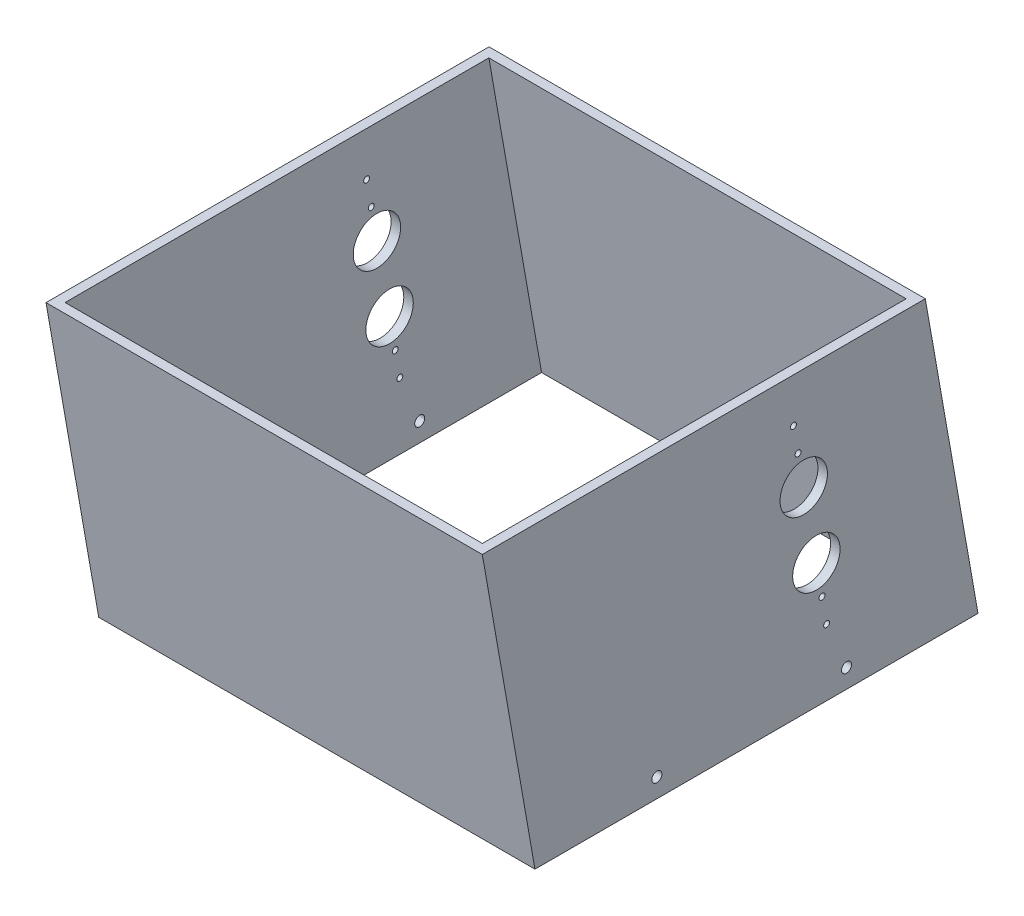
ISO-10303-21;
HEADER;
FILE_DESCRIPTION(('STEP AP214'),'2;1');
FILE_NAME('part.step','',(''),(''),'','','');
FILE_SCHEMA(('AUTOMOTIVE_DESIGN { 1 0 10303 214 1 1 1 1 }'));
ENDSEC;
DATA;
#1=APPLICATION_CONTEXT('core data for automotive mechanical design processes');
#2=APPLICATION_PROTOCOL_DEFINITION('international standard','automotive_design',2000,#1);
#3=PRODUCT_CONTEXT('',#1,'mechanical');
#4=PRODUCT('Part','Part','',(#3));
#5=PRODUCT_RELATED_PRODUCT_CATEGORY('part','',(#4));
#6=PRODUCT_DEFINITION_FORMATION('','',#4);
#7=PRODUCT_DEFINITION_CONTEXT('part definition',#1,'design');
#8=PRODUCT_DEFINITION('design','',#6,#7);
#9=PRODUCT_DEFINITION_SHAPE('','',#8);
#10=(LENGTH_UNIT() NAMED_UNIT(*) SI_UNIT(.MILLI.,.METRE.));
#11=(NAMED_UNIT(*) PLANE_ANGLE_UNIT() SI_UNIT($,.RADIAN.));
#12=(NAMED_UNIT(*) SI_UNIT($,.STERADIAN.) SOLID_ANGLE_UNIT());
#13=UNCERTAINTY_MEASURE_WITH_UNIT(LENGTH_MEASURE(1.E-05),#10,'distance_accuracy_value','');
#14=(GEOMETRIC_REPRESENTATION_CONTEXT(3) GLOBAL_UNCERTAINTY_ASSIGNED_CONTEXT((#13)) GLOBAL_UNIT_ASSIGNED_CONTEXT((#10,
#11,#12)) REPRESENTATION_CONTEXT('',''));
#15=CARTESIAN_POINT('',(0.,0.,0.));
#16=DIRECTION('',(0.,0.,1.));
#17=DIRECTION('',(1.,0.,0.));
#18=AXIS2_PLACEMENT_3D('',#15,#16,#17);
#19=CARTESIAN_POINT('',(-146.05,-68.6111825086534,-215.208710697034));
#20=DIRECTION('',(1.,0.,0.));
#21=DIRECTION('',(0.,0.,-1.));
#22=AXIS2_PLACEMENT_3D('',#19,#20,#21);
#23=CYLINDRICAL_SURFACE('',#22,15.875);
#24=CARTESIAN_POINT('',(139.7,-68.6111825086534,-215.208710697034));
#25=DIRECTION('',(1.,0.,0.));
#26=DIRECTION('',(0.,0.,-1.));
#27=AXIS2_PLACEMENT_3D('',#24,#25,#26);
#28=CIRCLE('',#27,15.875);
#29=CARTESIAN_POINT('',(139.7,-68.6111825086534,-231.083710697034));
#30=VERTEX_POINT('',#29);
#31=EDGE_CURVE('E20',#30,#30,#28,.F.);
#32=ORIENTED_EDGE('',*,*,#31,.T.);
#33=EDGE_LOOP('',(#32));
#34=FACE_BOUND('',#33,.T.);
#35=CARTESIAN_POINT('',(146.05,-68.6111825086534,-215.208710697034));
#36=DIRECTION('',(1.,0.,0.));
#37=DIRECTION('',(0.,0.,-1.));
#38=AXIS2_PLACEMENT_3D('',#35,#36,#37);
#39=CIRCLE('',#38,15.875);
#40=CARTESIAN_POINT('',(146.05,-68.6111825086534,-231.083710697034));
#41=VERTEX_POINT('',#40);
#42=EDGE_CURVE('E167',#41,#41,#39,.F.);
#43=ORIENTED_EDGE('',*,*,#42,.F.);
#44=EDGE_LOOP('',(#43));
#45=FACE_BOUND('',#44,.T.);
#46=ADVANCED_FACE('F17',(#34,#45),#23,.F.);
#47=CARTESIAN_POINT('',(-146.05,-116.638287007542,-223.677185025482));
#48=DIRECTION('',(1.,0.,0.));
#49=DIRECTION('',(0.,0.,-1.));
#50=AXIS2_PLACEMENT_3D('',#47,#48,#49);
#51=CYLINDRICAL_SURFACE('',#50,15.875);
#52=CARTESIAN_POINT('',(139.7,-116.638287007542,-223.677185025482));
#53=DIRECTION('',(1.,0.,0.));
#54=DIRECTION('',(0.,0.,-1.));
#55=AXIS2_PLACEMENT_3D('',#52,#53,#54);
#56=CIRCLE('',#55,15.875);
#57=CARTESIAN_POINT('',(139.7,-116.638287007542,-239.552185025482));
#58=VERTEX_POINT('',#57);
#59=EDGE_CURVE('E209',#58,#58,#56,.F.);
#60=ORIENTED_EDGE('',*,*,#59,.T.);
#61=EDGE_LOOP('',(#60));
#62=FACE_BOUND('',#61,.T.);
#63=CARTESIAN_POINT('',(146.05,-116.638287007542,-223.677185025482));
#64=DIRECTION('',(1.,0.,0.));
#65=DIRECTION('',(0.,0.,-1.));
#66=AXIS2_PLACEMENT_3D('',#63,#64,#65);
#67=CIRCLE('',#66,15.875);
#68=CARTESIAN_POINT('',(146.05,-116.638287007542,-239.552185025482));
#69=VERTEX_POINT('',#68);
#70=EDGE_CURVE('E164',#69,#69,#67,.F.);
#71=ORIENTED_EDGE('',*,*,#70,.F.);
#72=EDGE_LOOP('',(#71));
#73=FACE_BOUND('',#72,.T.);
#74=ADVANCED_FACE('F529',(#62,#73),#51,.F.);
#75=CARTESIAN_POINT('',(-146.05,-155.660309412896,-230.557820417371));
#76=DIRECTION('',(-1.,0.,0.));
#77=DIRECTION('',(0.,0.,1.));
#78=AXIS2_PLACEMENT_3D('',#75,#76,#77);
#79=CYLINDRICAL_SURFACE('',#78,1.9812);
#80=CARTESIAN_POINT('',(139.7,-155.660309412896,-230.557820417371));
#81=DIRECTION('',(-1.,0.,0.));
#82=DIRECTION('',(0.,0.,1.));
#83=AXIS2_PLACEMENT_3D('',#80,#81,#82);
#84=CIRCLE('',#83,1.9812);
#85=CARTESIAN_POINT('',(139.7,-155.660309412896,-228.576620417371));
#86=VERTEX_POINT('',#85);
#87=EDGE_CURVE('E207',#86,#86,#84,.T.);
#88=ORIENTED_EDGE('',*,*,#87,.T.);
#89=EDGE_LOOP('',(#88));
#90=FACE_BOUND('',#89,.T.);
#91=CARTESIAN_POINT('',(146.05,-155.660309412896,-230.557820417371));
#92=DIRECTION('',(-1.,0.,0.));
#93=DIRECTION('',(0.,0.,1.));
#94=AXIS2_PLACEMENT_3D('',#91,#92,#93);
#95=CIRCLE('',#94,1.9812);
#96=CARTESIAN_POINT('',(146.05,-155.660309412896,-228.576620417371));
#97=VERTEX_POINT('',#96);
#98=EDGE_CURVE('E161',#97,#97,#95,.T.);
#99=ORIENTED_EDGE('',*,*,#98,.F.);
#100=EDGE_LOOP('',(#99));
#101=FACE_BOUND('',#100,.T.);
#102=ADVANCED_FACE('F520',(#90,#101),#79,.F.);
#103=CARTESIAN_POINT('',(-146.05,-138.150427564353,-227.47035581845));
#104=DIRECTION('',(-1.,0.,0.));
#105=DIRECTION('',(0.,0.,1.));
#106=AXIS2_PLACEMENT_3D('',#103,#104,#105);
#107=CYLINDRICAL_SURFACE('',#106,1.9812);
#108=CARTESIAN_POINT('',(139.7,-138.150427564353,-227.47035581845));
#109=DIRECTION('',(-1.,0.,0.));
#110=DIRECTION('',(0.,0.,1.));
#111=AXIS2_PLACEMENT_3D('',#108,#109,#110);
#112=CIRCLE('',#111,1.9812);
#113=CARTESIAN_POINT('',(139.7,-138.150427564353,-225.48915581845));
#114=VERTEX_POINT('',#113);
#115=EDGE_CURVE('E204',#114,#114,#112,.T.);
#116=ORIENTED_EDGE('',*,*,#115,.T.);
#117=EDGE_LOOP('',(#116));
#118=FACE_BOUND('',#117,.T.);
#119=CARTESIAN_POINT('',(146.05,-138.150427564353,-227.47035581845));
#120=DIRECTION('',(-1.,0.,0.));
#121=DIRECTION('',(0.,0.,1.));
#122=AXIS2_PLACEMENT_3D('',#119,#120,#121);
#123=CIRCLE('',#122,1.9812);
#124=CARTESIAN_POINT('',(146.05,-138.150427564353,-225.48915581845));
#125=VERTEX_POINT('',#124);
#126=EDGE_CURVE('E158',#125,#125,#123,.T.);
#127=ORIENTED_EDGE('',*,*,#126,.F.);
#128=EDGE_LOOP('',(#127));
#129=FACE_BOUND('',#128,.T.);
#130=ADVANCED_FACE('F511',(#118,#129),#107,.F.);
#131=CARTESIAN_POINT('',(-146.05,-47.099041951842,-211.415539904092));
#132=DIRECTION('',(-1.,0.,0.));
#133=DIRECTION('',(0.,0.,1.));
#134=AXIS2_PLACEMENT_3D('',#131,#132,#133);
#135=CYLINDRICAL_SURFACE('',#134,1.9812);
#136=CARTESIAN_POINT('',(139.7,-47.099041951842,-211.415539904092));
#137=DIRECTION('',(-1.,0.,0.));
#138=DIRECTION('',(0.,0.,1.));
#139=AXIS2_PLACEMENT_3D('',#136,#137,#138);
#140=CIRCLE('',#139,1.9812);
#141=CARTESIAN_POINT('',(139.7,-47.099041951842,-209.434339904092));
#142=VERTEX_POINT('',#141);
#143=EDGE_CURVE('E201',#142,#142,#140,.T.);
#144=ORIENTED_EDGE('',*,*,#143,.T.);
#145=EDGE_LOOP('',(#144));
#146=FACE_BOUND('',#145,.T.);
#147=CARTESIAN_POINT('',(146.05,-47.099041951842,-211.415539904092));
#148=DIRECTION('',(-1.,0.,0.));
#149=DIRECTION('',(0.,0.,1.));
#150=AXIS2_PLACEMENT_3D('',#147,#148,#149);
#151=CIRCLE('',#150,1.9812);
#152=CARTESIAN_POINT('',(146.05,-47.099041951842,-209.434339904092));
#153=VERTEX_POINT('',#152);
#154=EDGE_CURVE('E155',#153,#153,#151,.T.);
#155=ORIENTED_EDGE('',*,*,#154,.F.);
#156=EDGE_LOOP('',(#155));
#157=FACE_BOUND('',#156,.T.);
#158=ADVANCED_FACE('F502',(#146,#157),#135,.F.);
#159=CARTESIAN_POINT('',(-146.05,-29.5891601032988,-208.32807530517));
#160=DIRECTION('',(-1.,0.,0.));
#161=DIRECTION('',(0.,0.,1.));
#162=AXIS2_PLACEMENT_3D('',#159,#160,#161);
#163=CYLINDRICAL_SURFACE('',#162,1.9812);
#164=CARTESIAN_POINT('',(139.7,-29.5891601032988,-208.32807530517));
#165=DIRECTION('',(-1.,0.,0.));
#166=DIRECTION('',(0.,0.,1.));
#167=AXIS2_PLACEMENT_3D('',#164,#165,#166);
#168=CIRCLE('',#167,1.9812);
#169=CARTESIAN_POINT('',(139.7,-29.5891601032988,-206.34687530517));
#170=VERTEX_POINT('',#169);
#171=EDGE_CURVE('E198',#170,#170,#168,.T.);
#172=ORIENTED_EDGE('',*,*,#171,.T.);
#173=EDGE_LOOP('',(#172));
#174=FACE_BOUND('',#173,.T.);
#175=CARTESIAN_POINT('',(146.05,-29.5891601032988,-208.32807530517));
#176=DIRECTION('',(-1.,0.,0.));
#177=DIRECTION('',(0.,0.,1.));
#178=AXIS2_PLACEMENT_3D('',#175,#176,#177);
#179=CIRCLE('',#178,1.9812);
#180=CARTESIAN_POINT('',(146.05,-29.5891601032988,-206.34687530517));
#181=VERTEX_POINT('',#180);
#182=EDGE_CURVE('E152',#181,#181,#179,.T.);
#183=ORIENTED_EDGE('',*,*,#182,.F.);
#184=EDGE_LOOP('',(#183));
#185=FACE_BOUND('',#184,.T.);
#186=ADVANCED_FACE('F493',(#174,#185),#163,.F.);
#187=CARTESIAN_POINT('',(146.3675,-187.412935412089,-116.869423858094));
#188=DIRECTION('',(-1.,0.,0.));
#189=DIRECTION('',(0.,0.,1.));
#190=AXIS2_PLACEMENT_3D('',#187,#188,#189);
#191=CYLINDRICAL_SURFACE('',#190,3.3655);
#192=CARTESIAN_POINT('',(139.7,-187.412935412089,-116.869423858094));
#193=DIRECTION('',(-1.,0.,0.));
#194=DIRECTION('',(0.,0.,1.));
#195=AXIS2_PLACEMENT_3D('',#192,#193,#194);
#196=CIRCLE('',#195,3.3655);
#197=CARTESIAN_POINT('',(139.7,-187.412935412089,-113.503923858094));
#198=VERTEX_POINT('',#197);
#199=EDGE_CURVE('E195',#198,#198,#196,.T.);
#200=ORIENTED_EDGE('',*,*,#199,.T.);
#201=EDGE_LOOP('',(#200));
#202=FACE_BOUND('',#201,.T.);
#203=CARTESIAN_POINT('',(146.05,-187.412935412089,-116.869423858094));
#204=DIRECTION('',(-1.,0.,0.));
#205=DIRECTION('',(0.,0.,1.));
#206=AXIS2_PLACEMENT_3D('',#203,#204,#205);
#207=CIRCLE('',#206,3.3655);
#208=CARTESIAN_POINT('',(146.05,-187.412935412089,-113.503923858094));
#209=VERTEX_POINT('',#208);
#210=EDGE_CURVE('E149',#209,#209,#207,.T.);
#211=ORIENTED_EDGE('',*,*,#210,.F.);
#212=EDGE_LOOP('',(#211));
#213=FACE_BOUND('',#212,.T.);
#214=ADVANCED_FACE('F484',(#202,#213),#191,.F.);
#215=CARTESIAN_POINT('',(146.3675,-187.412935412089,-243.869423858094));
#216=DIRECTION('',(-1.,0.,0.));
#217=DIRECTION('',(0.,0.,1.));
#218=AXIS2_PLACEMENT_3D('',#215,#216,#217);
#219=CYLINDRICAL_SURFACE('',#218,3.3655);
#220=CARTESIAN_POINT('',(139.7,-187.412935412089,-243.869423858094));
#221=DIRECTION('',(-1.,0.,0.));
#222=DIRECTION('',(0.,0.,1.));
#223=AXIS2_PLACEMENT_3D('',#220,#221,#222);
#224=CIRCLE('',#223,3.3655);
#225=CARTESIAN_POINT('',(139.7,-187.412935412089,-240.503923858094));
#226=VERTEX_POINT('',#225);
#227=EDGE_CURVE('E92',#226,#226,#224,.T.);
#228=ORIENTED_EDGE('',*,*,#227,.T.);
#229=EDGE_LOOP('',(#228));
#230=FACE_BOUND('',#229,.T.);
#231=CARTESIAN_POINT('',(146.05,-187.412935412089,-243.869423858094));
#232=DIRECTION('',(-1.,0.,0.));
#233=DIRECTION('',(0.,0.,1.));
#234=AXIS2_PLACEMENT_3D('',#231,#232,#233);
#235=CIRCLE('',#234,3.3655);
#236=CARTESIAN_POINT('',(146.05,-187.412935412089,-240.503923858094));
#237=VERTEX_POINT('',#236);
#238=EDGE_CURVE('E145',#237,#237,#235,.T.);
#239=ORIENTED_EDGE('',*,*,#238,.F.);
#240=EDGE_LOOP('',(#239));
#241=FACE_BOUND('',#240,.T.);
#242=ADVANCED_FACE('F229',(#230,#241),#219,.F.);
#243=CARTESIAN_POINT('',(-139.7,-200.112935412089,-325.44346404827));
#244=DIRECTION('',(0.,0.173648177666902,-0.984807753012213));
#245=DIRECTION('',(0.,0.984807753012213,0.173648177666902));
#246=AXIS2_PLACEMENT_3D('',#243,#244,#245);
#247=PLANE('',#246);
#248=DIRECTION('',(1.,0.,0.));
#249=VECTOR('',#248,1.);
#250=CARTESIAN_POINT('',(-146.05,0.,-290.158154346234));
#251=LINE('',#250,#249);
#252=CARTESIAN_POINT('',(-139.7,1.02730324247347E-11,-290.158154346292));
#253=VERTEX_POINT('',#252);
#254=CARTESIAN_POINT('',(139.7,1.02730324247347E-11,-290.158154346292));
#255=VERTEX_POINT('',#254);
#256=EDGE_CURVE('E320',#253,#255,#251,.T.);
#257=ORIENTED_EDGE('',*,*,#256,.F.);
#258=DIRECTION('',(0.,0.984807753012112,0.173648177667476));
#259=VECTOR('',#258,1.);
#260=CARTESIAN_POINT('',(-139.7,-200.112935412089,-325.44346404827));
#261=LINE('',#260,#259);
#262=CARTESIAN_POINT('',(-139.7,-200.112935412089,-325.44346404827));
#263=VERTEX_POINT('',#262);
#264=EDGE_CURVE('E91',#263,#253,#261,.T.);
#265=ORIENTED_EDGE('',*,*,#264,.F.);
#266=DIRECTION('',(1.,0.,0.));
#267=VECTOR('',#266,1.);
#268=CARTESIAN_POINT('',(-146.05,-200.112935412089,-325.44346404827));
#269=LINE('',#268,#267);
#270=CARTESIAN_POINT('',(139.7,-200.112935412089,-325.44346404827));
#271=VERTEX_POINT('',#270);
#272=EDGE_CURVE('E101',#271,#263,#269,.F.);
#273=ORIENTED_EDGE('',*,*,#272,.F.);
#274=DIRECTION('',(0.,0.984807753012112,0.173648177667476));
#275=VECTOR('',#274,1.);
#276=CARTESIAN_POINT('',(139.7,-200.112935412089,-325.44346404827));
#277=LINE('',#276,#275);
#278=EDGE_CURVE('E97',#271,#255,#277,.T.);
#279=ORIENTED_EDGE('',*,*,#278,.T.);
#280=EDGE_LOOP('',(#257,#265,#273,#279));
#281=FACE_BOUND('',#280,.T.);
#282=ADVANCED_FACE('F219',(#281),#247,.F.);
#283=CARTESIAN_POINT('',(139.7,0.,0.));
#284=DIRECTION('',(1.,0.,0.));
#285=DIRECTION('',(0.,0.,-1.));
#286=AXIS2_PLACEMENT_3D('',#283,#284,#285);
#287=PLANE('',#286);
#288=ORIENTED_EDGE('',*,*,#227,.F.);
#289=EDGE_LOOP('',(#288));
#290=FACE_BOUND('',#289,.T.);
#291=ORIENTED_EDGE('',*,*,#199,.F.);
#292=EDGE_LOOP('',(#291));
#293=FACE_BOUND('',#292,.T.);
#294=ORIENTED_EDGE('',*,*,#171,.F.);
#295=EDGE_LOOP('',(#294));
#296=FACE_BOUND('',#295,.T.);
#297=ORIENTED_EDGE('',*,*,#143,.F.);
#298=EDGE_LOOP('',(#297));
#299=FACE_BOUND('',#298,.T.);
#300=ORIENTED_EDGE('',*,*,#115,.F.);
#301=EDGE_LOOP('',(#300));
#302=FACE_BOUND('',#301,.T.);
#303=ORIENTED_EDGE('',*,*,#87,.F.);
#304=EDGE_LOOP('',(#303));
#305=FACE_BOUND('',#304,.T.);
#306=ORIENTED_EDGE('',*,*,#59,.F.);
#307=EDGE_LOOP('',(#306));
#308=FACE_BOUND('',#307,.T.);
#309=ORIENTED_EDGE('',*,*,#31,.F.);
#310=EDGE_LOOP('',(#309));
#311=FACE_BOUND('',#310,.T.);
#312=DIRECTION('',(0.,0.,1.));
#313=VECTOR('',#312,1.);
#314=CARTESIAN_POINT('',(139.7,0.,-296.606113331926));
#315=LINE('',#314,#313);
#316=CARTESIAN_POINT('',(139.7,0.,-6.44795898547356));
#317=VERTEX_POINT('',#316);
#318=EDGE_CURVE('E318',#255,#317,#315,.T.);
#319=ORIENTED_EDGE('',*,*,#318,.F.);
#320=ORIENTED_EDGE('',*,*,#278,.F.);
#321=DIRECTION('',(0.,0.,-1.));
#322=VECTOR('',#321,1.);
#323=CARTESIAN_POINT('',(139.7,-200.112935412089,-35.285309701909));
#324=LINE('',#323,#322);
#325=CARTESIAN_POINT('',(139.7,-200.11293541209,-41.7332686873937));
#326=VERTEX_POINT('',#325);
#327=EDGE_CURVE('E95',#326,#271,#324,.T.);
#328=ORIENTED_EDGE('',*,*,#327,.F.);
#329=DIRECTION('',(0.,-0.984807753012213,-0.173648177666902));
#330=VECTOR('',#329,1.);
#331=CARTESIAN_POINT('',(139.7,0.,-6.44795898547356));
#332=LINE('',#331,#330);
#333=EDGE_CURVE('E83',#326,#317,#332,.F.);
#334=ORIENTED_EDGE('',*,*,#333,.T.);
#335=EDGE_LOOP('',(#319,#320,#328,#334));
#336=FACE_BOUND('',#335,.T.);
#337=ADVANCED_FACE('F96',(#290,#293,#296,#299,#302,#305,#308,#311,#336),#287,.F.);
#338=CARTESIAN_POINT('',(-139.7,0.,-6.44795898547356));
#339=DIRECTION('',(0.,-0.173648177666902,0.984807753012213));
#340=DIRECTION('',(0.,-0.984807753012213,-0.173648177666902));
#341=AXIS2_PLACEMENT_3D('',#338,#339,#340);
#342=PLANE('',#341);
#343=DIRECTION('',(1.,0.,0.));
#344=VECTOR('',#343,1.);
#345=CARTESIAN_POINT('',(-146.05,0.,-6.44795898547357));
#346=LINE('',#345,#344);
#347=CARTESIAN_POINT('',(-139.7,0.,-6.44795898547356));
#348=VERTEX_POINT('',#347);
#349=EDGE_CURVE('E87',#317,#348,#346,.F.);
#350=ORIENTED_EDGE('',*,*,#349,.F.);
#351=ORIENTED_EDGE('',*,*,#333,.F.);
#352=DIRECTION('',(1.,0.,0.));
#353=VECTOR('',#352,1.);
#354=CARTESIAN_POINT('',(-146.05,-200.112935412089,-41.7332686873978));
#355=LINE('',#354,#353);
#356=CARTESIAN_POINT('',(-139.7,-200.11293541209,-41.7332686873937));
#357=VERTEX_POINT('',#356);
#358=EDGE_CURVE('E80',#357,#326,#355,.T.);
#359=ORIENTED_EDGE('',*,*,#358,.F.);
#360=DIRECTION('',(0.,-0.984807753012206,-0.173648177666942));
#361=VECTOR('',#360,1.);
#362=CARTESIAN_POINT('',(-139.7,0.,-6.44795898547356));
#363=LINE('',#362,#361);
#364=EDGE_CURVE('E114',#348,#357,#363,.T.);
#365=ORIENTED_EDGE('',*,*,#364,.F.);
#366=EDGE_LOOP('',(#350,#351,#359,#365));
#367=FACE_BOUND('',#366,.T.);
#368=ADVANCED_FACE('F85',(#367),#342,.F.);
#369=CARTESIAN_POINT('',(-139.7,0.,0.));
#370=DIRECTION('',(1.,0.,0.));
#371=DIRECTION('',(0.,0.,-1.));
#372=AXIS2_PLACEMENT_3D('',#369,#370,#371);
#373=PLANE('',#372);
#374=CARTESIAN_POINT('',(-139.7,-187.412935412089,-243.869423858094));
#375=DIRECTION('',(-1.,0.,0.));
#376=DIRECTION('',(0.,0.,1.));
#377=AXIS2_PLACEMENT_3D('',#374,#375,#376);
#378=CIRCLE('',#377,3.3655);
#379=CARTESIAN_POINT('',(-139.7,-187.412935412089,-240.503923858094));
#380=VERTEX_POINT('',#379);
#381=EDGE_CURVE('E110',#380,#380,#378,.T.);
#382=ORIENTED_EDGE('',*,*,#381,.T.);
#383=EDGE_LOOP('',(#382));
#384=FACE_BOUND('',#383,.T.);
#385=CARTESIAN_POINT('',(-139.7,-187.412935412089,-116.869423858094));
#386=DIRECTION('',(-1.,0.,0.));
#387=DIRECTION('',(0.,0.,1.));
#388=AXIS2_PLACEMENT_3D('',#385,#386,#387);
#389=CIRCLE('',#388,3.3655);
#390=CARTESIAN_POINT('',(-139.7,-187.412935412089,-113.503923858094));
#391=VERTEX_POINT('',#390);
#392=EDGE_CURVE('E173',#391,#391,#389,.T.);
#393=ORIENTED_EDGE('',*,*,#392,.T.);
#394=EDGE_LOOP('',(#393));
#395=FACE_BOUND('',#394,.T.);
#396=CARTESIAN_POINT('',(-139.7,-29.5891601032988,-208.32807530517));
#397=DIRECTION('',(-1.,0.,0.));
#398=DIRECTION('',(0.,0.,1.));
#399=AXIS2_PLACEMENT_3D('',#396,#397,#398);
#400=CIRCLE('',#399,1.9812);
#401=CARTESIAN_POINT('',(-139.7,-29.5891601032988,-206.34687530517));
#402=VERTEX_POINT('',#401);
#403=EDGE_CURVE('E176',#402,#402,#400,.T.);
#404=ORIENTED_EDGE('',*,*,#403,.T.);
#405=EDGE_LOOP('',(#404));
#406=FACE_BOUND('',#405,.T.);
#407=CARTESIAN_POINT('',(-139.7,-47.099041951842,-211.415539904092));
#408=DIRECTION('',(-1.,0.,0.));
#409=DIRECTION('',(0.,0.,1.));
#410=AXIS2_PLACEMENT_3D('',#407,#408,#409);
#411=CIRCLE('',#410,1.9812);
#412=CARTESIAN_POINT('',(-139.7,-47.099041951842,-209.434339904092));
#413=VERTEX_POINT('',#412);
#414=EDGE_CURVE('E179',#413,#413,#411,.T.);
#415=ORIENTED_EDGE('',*,*,#414,.T.);
#416=EDGE_LOOP('',(#415));
#417=FACE_BOUND('',#416,.T.);
#418=CARTESIAN_POINT('',(-139.7,-138.150427564353,-227.47035581845));
#419=DIRECTION('',(-1.,0.,0.));
#420=DIRECTION('',(0.,0.,1.));
#421=AXIS2_PLACEMENT_3D('',#418,#419,#420);
#422=CIRCLE('',#421,1.9812);
#423=CARTESIAN_POINT('',(-139.7,-138.150427564353,-225.48915581845));
#424=VERTEX_POINT('',#423);
#425=EDGE_CURVE('E182',#424,#424,#422,.T.);
#426=ORIENTED_EDGE('',*,*,#425,.T.);
#427=EDGE_LOOP('',(#426));
#428=FACE_BOUND('',#427,.T.);
#429=CARTESIAN_POINT('',(-139.7,-155.660309412896,-230.557820417371));
#430=DIRECTION('',(-1.,0.,0.));
#431=DIRECTION('',(0.,0.,1.));
#432=AXIS2_PLACEMENT_3D('',#429,#430,#431);
#433=CIRCLE('',#432,1.9812);
#434=CARTESIAN_POINT('',(-139.7,-155.660309412896,-228.576620417371));
#435=VERTEX_POINT('',#434);
#436=EDGE_CURVE('E185',#435,#435,#433,.T.);
#437=ORIENTED_EDGE('',*,*,#436,.T.);
#438=EDGE_LOOP('',(#437));
#439=FACE_BOUND('',#438,.T.);
#440=CARTESIAN_POINT('',(-139.7,-116.638287007542,-223.677185025482));
#441=DIRECTION('',(1.,0.,0.));
#442=DIRECTION('',(0.,0.,-1.));
#443=AXIS2_PLACEMENT_3D('',#440,#441,#442);
#444=CIRCLE('',#443,15.875);
#445=CARTESIAN_POINT('',(-139.7,-116.638287007542,-239.552185025482));
#446=VERTEX_POINT('',#445);
#447=EDGE_CURVE('E188',#446,#446,#444,.F.);
#448=ORIENTED_EDGE('',*,*,#447,.T.);
#449=EDGE_LOOP('',(#448));
#450=FACE_BOUND('',#449,.T.);
#451=CARTESIAN_POINT('',(-139.7,-68.6111825086534,-215.208710697034));
#452=DIRECTION('',(1.,0.,0.));
#453=DIRECTION('',(0.,0.,-1.));
#454=AXIS2_PLACEMENT_3D('',#451,#452,#453);
#455=CIRCLE('',#454,15.875);
#456=CARTESIAN_POINT('',(-139.7,-68.6111825086534,-231.083710697034));
#457=VERTEX_POINT('',#456);
#458=EDGE_CURVE('E116',#457,#457,#455,.F.);
#459=ORIENTED_EDGE('',*,*,#458,.T.);
#460=EDGE_LOOP('',(#459));
#461=FACE_BOUND('',#460,.T.);
#462=ORIENTED_EDGE('',*,*,#364,.T.);
#463=DIRECTION('',(0.,0.,-1.));
#464=VECTOR('',#463,1.);
#465=CARTESIAN_POINT('',(-139.7,-200.112935412089,-35.285309701909));
#466=LINE('',#465,#464);
#467=EDGE_CURVE('E107',#263,#357,#466,.F.);
#468=ORIENTED_EDGE('',*,*,#467,.F.);
#469=ORIENTED_EDGE('',*,*,#264,.T.);
#470=DIRECTION('',(0.,0.,1.));
#471=VECTOR('',#470,1.);
#472=CARTESIAN_POINT('',(-139.7,0.,-296.606113331926));
#473=LINE('',#472,#471);
#474=EDGE_CURVE('E314',#348,#253,#473,.F.);
#475=ORIENTED_EDGE('',*,*,#474,.F.);
#476=EDGE_LOOP('',(#462,#468,#469,#475));
#477=FACE_BOUND('',#476,.T.);
#478=ADVANCED_FACE('F227',(#384,#395,#406,#417,#428,#439,#450,#461,#477),#373,.T.);
#479=CARTESIAN_POINT('',(-146.05,-200.112935412089,-331.891423033708));
#480=DIRECTION('',(0.,0.173648177666902,-0.984807753012213));
#481=DIRECTION('',(0.,0.984807753012213,0.173648177666902));
#482=AXIS2_PLACEMENT_3D('',#479,#480,#481);
#483=PLANE('',#482);
#484=DIRECTION('',(1.,0.,0.));
#485=VECTOR('',#484,1.);
#486=CARTESIAN_POINT('',(-146.05,-200.112935412089,-331.891423033708));
#487=LINE('',#486,#485);
#488=CARTESIAN_POINT('',(-146.05,-200.112935412089,-331.891423033708));
#489=VERTEX_POINT('',#488);
#490=CARTESIAN_POINT('',(146.05,-200.112935412089,-331.891423033708));
#491=VERTEX_POINT('',#490);
#492=EDGE_CURVE('E108',#489,#491,#487,.T.);
#493=ORIENTED_EDGE('',*,*,#492,.F.);
#494=DIRECTION('',(0.,0.984807753012326,0.173648177666263));
#495=VECTOR('',#494,1.);
#496=CARTESIAN_POINT('',(-146.05,-200.112935412089,-331.891423033708));
#497=LINE('',#496,#495);
#498=CARTESIAN_POINT('',(-146.05,-1.14491749414469E-11,-296.606113331861));
#499=VERTEX_POINT('',#498);
#500=EDGE_CURVE('E343',#489,#499,#497,.T.);
#501=ORIENTED_EDGE('',*,*,#500,.T.);
#502=DIRECTION('',(1.,0.,0.));
#503=VECTOR('',#502,1.);
#504=CARTESIAN_POINT('',(-146.05,0.,-296.606113331926));
#505=LINE('',#504,#503);
#506=CARTESIAN_POINT('',(146.05,-5.72458747072346E-12,-296.606113331894));
#507=VERTEX_POINT('',#506);
#508=EDGE_CURVE('E325',#507,#499,#505,.F.);
#509=ORIENTED_EDGE('',*,*,#508,.F.);
#510=DIRECTION('',(0.,0.984807753012326,0.173648177666263));
#511=VECTOR('',#510,1.);
#512=CARTESIAN_POINT('',(146.05,-200.112935412089,-331.891423033708));
#513=LINE('',#512,#511);
#514=EDGE_CURVE('E170',#491,#507,#513,.T.);
#515=ORIENTED_EDGE('',*,*,#514,.F.);
#516=EDGE_LOOP('',(#493,#501,#509,#515));
#517=FACE_BOUND('',#516,.T.);
#518=ADVANCED_FACE('F287',(#517),#483,.T.);
#519=CARTESIAN_POINT('',(-146.05,-68.6111825086534,-215.208710697034));
#520=DIRECTION('',(1.,0.,0.));
#521=DIRECTION('',(0.,0.,-1.));
#522=AXIS2_PLACEMENT_3D('',#519,#520,#521);
#523=CYLINDRICAL_SURFACE('',#522,15.875);
#524=ORIENTED_EDGE('',*,*,#458,.F.);
#525=EDGE_LOOP('',(#524));
#526=FACE_BOUND('',#525,.T.);
#527=CARTESIAN_POINT('',(-146.05,-68.6111825086534,-215.208710697034));
#528=DIRECTION('',(1.,0.,0.));
#529=DIRECTION('',(0.,0.,-1.));
#530=AXIS2_PLACEMENT_3D('',#527,#528,#529);
#531=CIRCLE('',#530,15.875);
#532=CARTESIAN_POINT('',(-146.05,-68.6111825086534,-231.083710697034));
#533=VERTEX_POINT('',#532);
#534=EDGE_CURVE('E142',#533,#533,#531,.F.);
#535=ORIENTED_EDGE('',*,*,#534,.T.);
#536=EDGE_LOOP('',(#535));
#537=FACE_BOUND('',#536,.T.);
#538=ADVANCED_FACE('F283',(#526,#537),#523,.F.);
#539=CARTESIAN_POINT('',(-146.05,-116.638287007542,-223.677185025482));
#540=DIRECTION('',(1.,0.,0.));
#541=DIRECTION('',(0.,0.,-1.));
#542=AXIS2_PLACEMENT_3D('',#539,#540,#541);
#543=CYLINDRICAL_SURFACE('',#542,15.875);
#544=ORIENTED_EDGE('',*,*,#447,.F.);
#545=EDGE_LOOP('',(#544));
#546=FACE_BOUND('',#545,.T.);
#547=CARTESIAN_POINT('',(-146.05,-116.638287007542,-223.677185025482));
#548=DIRECTION('',(1.,0.,0.));
#549=DIRECTION('',(0.,0.,-1.));
#550=AXIS2_PLACEMENT_3D('',#547,#548,#549);
#551=CIRCLE('',#550,15.875);
#552=CARTESIAN_POINT('',(-146.05,-116.638287007542,-239.552185025482));
#553=VERTEX_POINT('',#552);
#554=EDGE_CURVE('E139',#553,#553,#551,.F.);
#555=ORIENTED_EDGE('',*,*,#554,.T.);
#556=EDGE_LOOP('',(#555));
#557=FACE_BOUND('',#556,.T.);
#558=ADVANCED_FACE('F279',(#546,#557),#543,.F.);
#559=CARTESIAN_POINT('',(-146.05,-155.660309412896,-230.557820417371));
#560=DIRECTION('',(-1.,0.,0.));
#561=DIRECTION('',(0.,0.,1.));
#562=AXIS2_PLACEMENT_3D('',#559,#560,#561);
#563=CYLINDRICAL_SURFACE('',#562,1.9812);
#564=ORIENTED_EDGE('',*,*,#436,.F.);
#565=EDGE_LOOP('',(#564));
#566=FACE_BOUND('',#565,.T.);
#567=CARTESIAN_POINT('',(-146.05,-155.660309412896,-230.557820417371));
#568=DIRECTION('',(-1.,0.,0.));
#569=DIRECTION('',(0.,0.,1.));
#570=AXIS2_PLACEMENT_3D('',#567,#568,#569);
#571=CIRCLE('',#570,1.9812);
#572=CARTESIAN_POINT('',(-146.05,-155.660309412896,-228.576620417371));
#573=VERTEX_POINT('',#572);
#574=EDGE_CURVE('E136',#573,#573,#571,.T.);
#575=ORIENTED_EDGE('',*,*,#574,.T.);
#576=EDGE_LOOP('',(#575));
#577=FACE_BOUND('',#576,.T.);
#578=ADVANCED_FACE('F275',(#566,#577),#563,.F.);
#579=CARTESIAN_POINT('',(-146.05,-138.150427564353,-227.47035581845));
#580=DIRECTION('',(-1.,0.,0.));
#581=DIRECTION('',(0.,0.,1.));
#582=AXIS2_PLACEMENT_3D('',#579,#580,#581);
#583=CYLINDRICAL_SURFACE('',#582,1.9812);
#584=ORIENTED_EDGE('',*,*,#425,.F.);
#585=EDGE_LOOP('',(#584));
#586=FACE_BOUND('',#585,.T.);
#587=CARTESIAN_POINT('',(-146.05,-138.150427564353,-227.47035581845));
#588=DIRECTION('',(-1.,0.,0.));
#589=DIRECTION('',(0.,0.,1.));
#590=AXIS2_PLACEMENT_3D('',#587,#588,#589);
#591=CIRCLE('',#590,1.9812);
#592=CARTESIAN_POINT('',(-146.05,-138.150427564353,-225.48915581845));
#593=VERTEX_POINT('',#592);
#594=EDGE_CURVE('E133',#593,#593,#591,.T.);
#595=ORIENTED_EDGE('',*,*,#594,.T.);
#596=EDGE_LOOP('',(#595));
#597=FACE_BOUND('',#596,.T.);
#598=ADVANCED_FACE('F271',(#586,#597),#583,.F.);
#599=CARTESIAN_POINT('',(-146.05,-47.099041951842,-211.415539904092));
#600=DIRECTION('',(-1.,0.,0.));
#601=DIRECTION('',(0.,0.,1.));
#602=AXIS2_PLACEMENT_3D('',#599,#600,#601);
#603=CYLINDRICAL_SURFACE('',#602,1.9812);
#604=ORIENTED_EDGE('',*,*,#414,.F.);
#605=EDGE_LOOP('',(#604));
#606=FACE_BOUND('',#605,.T.);
#607=CARTESIAN_POINT('',(-146.05,-47.099041951842,-211.415539904092));
#608=DIRECTION('',(-1.,0.,0.));
#609=DIRECTION('',(0.,0.,1.));
#610=AXIS2_PLACEMENT_3D('',#607,#608,#609);
#611=CIRCLE('',#610,1.9812);
#612=CARTESIAN_POINT('',(-146.05,-47.099041951842,-209.434339904092));
#613=VERTEX_POINT('',#612);
#614=EDGE_CURVE('E130',#613,#613,#611,.T.);
#615=ORIENTED_EDGE('',*,*,#614,.T.);
#616=EDGE_LOOP('',(#615));
#617=FACE_BOUND('',#616,.T.);
#618=ADVANCED_FACE('F267',(#606,#617),#603,.F.);
#619=CARTESIAN_POINT('',(-146.05,-29.5891601032988,-208.32807530517));
#620=DIRECTION('',(-1.,0.,0.));
#621=DIRECTION('',(0.,0.,1.));
#622=AXIS2_PLACEMENT_3D('',#619,#620,#621);
#623=CYLINDRICAL_SURFACE('',#622,1.9812);
#624=ORIENTED_EDGE('',*,*,#403,.F.);
#625=EDGE_LOOP('',(#624));
#626=FACE_BOUND('',#625,.T.);
#627=CARTESIAN_POINT('',(-146.05,-29.5891601032988,-208.32807530517));
#628=DIRECTION('',(-1.,0.,0.));
#629=DIRECTION('',(0.,0.,1.));
#630=AXIS2_PLACEMENT_3D('',#627,#628,#629);
#631=CIRCLE('',#630,1.9812);
#632=CARTESIAN_POINT('',(-146.05,-29.5891601032988,-206.34687530517));
#633=VERTEX_POINT('',#632);
#634=EDGE_CURVE('E127',#633,#633,#631,.T.);
#635=ORIENTED_EDGE('',*,*,#634,.T.);
#636=EDGE_LOOP('',(#635));
#637=FACE_BOUND('',#636,.T.);
#638=ADVANCED_FACE('F263',(#626,#637),#623,.F.);
#639=CARTESIAN_POINT('',(-146.3675,-187.412935412089,-116.869423858094));
#640=DIRECTION('',(-1.,0.,0.));
#641=DIRECTION('',(0.,0.,1.));
#642=AXIS2_PLACEMENT_3D('',#639,#640,#641);
#643=CYLINDRICAL_SURFACE('',#642,3.3655);
#644=CARTESIAN_POINT('',(-146.05,-187.412935412089,-116.869423858094));
#645=DIRECTION('',(-1.,0.,0.));
#646=DIRECTION('',(0.,0.,1.));
#647=AXIS2_PLACEMENT_3D('',#644,#645,#646);
#648=CIRCLE('',#647,3.3655);
#649=CARTESIAN_POINT('',(-146.05,-187.412935412089,-113.503923858094));
#650=VERTEX_POINT('',#649);
#651=EDGE_CURVE('E124',#650,#650,#648,.T.);
#652=ORIENTED_EDGE('',*,*,#651,.T.);
#653=EDGE_LOOP('',(#652));
#654=FACE_BOUND('',#653,.T.);
#655=ORIENTED_EDGE('',*,*,#392,.F.);
#656=EDGE_LOOP('',(#655));
#657=FACE_BOUND('',#656,.T.);
#658=ADVANCED_FACE('F259',(#654,#657),#643,.F.);
#659=CARTESIAN_POINT('',(-146.3675,-187.412935412089,-243.869423858094));
#660=DIRECTION('',(-1.,0.,0.));
#661=DIRECTION('',(0.,0.,1.));
#662=AXIS2_PLACEMENT_3D('',#659,#660,#661);
#663=CYLINDRICAL_SURFACE('',#662,3.3655);
#664=CARTESIAN_POINT('',(-146.05,-187.412935412089,-243.869423858094));
#665=DIRECTION('',(-1.,0.,0.));
#666=DIRECTION('',(0.,0.,1.));
#667=AXIS2_PLACEMENT_3D('',#664,#665,#666);
#668=CIRCLE('',#667,3.3655);
#669=CARTESIAN_POINT('',(-146.05,-187.412935412089,-240.503923858094));
#670=VERTEX_POINT('',#669);
#671=EDGE_CURVE('E120',#670,#670,#668,.T.);
#672=ORIENTED_EDGE('',*,*,#671,.T.);
#673=EDGE_LOOP('',(#672));
#674=FACE_BOUND('',#673,.T.);
#675=ORIENTED_EDGE('',*,*,#381,.F.);
#676=EDGE_LOOP('',(#675));
#677=FACE_BOUND('',#676,.T.);
#678=ADVANCED_FACE('F256',(#674,#677),#663,.F.);
#679=CARTESIAN_POINT('',(-146.05,-200.112935412089,-35.285309701909));
#680=DIRECTION('',(0.,-1.,0.));
#681=DIRECTION('',(0.,0.,-1.));
#682=AXIS2_PLACEMENT_3D('',#679,#680,#681);
#683=PLANE('',#682);
#684=ORIENTED_EDGE('',*,*,#272,.T.);
#685=ORIENTED_EDGE('',*,*,#467,.T.);
#686=ORIENTED_EDGE('',*,*,#358,.T.);
#687=ORIENTED_EDGE('',*,*,#327,.T.);
#688=EDGE_LOOP('',(#684,#685,#686,#687));
#689=FACE_BOUND('',#688,.T.);
#690=DIRECTION('',(1.,0.,0.));
#691=VECTOR('',#690,1.);
#692=CARTESIAN_POINT('',(-146.05,-200.112935412088,-35.2853097019157));
#693=LINE('',#692,#691);
#694=CARTESIAN_POINT('',(-146.05,-200.112935412089,-35.2853097019107));
#695=VERTEX_POINT('',#694);
#696=CARTESIAN_POINT('',(146.05,-200.112935412089,-35.2853097019107));
#697=VERTEX_POINT('',#696);
#698=EDGE_CURVE('E123',#695,#697,#693,.T.);
#699=ORIENTED_EDGE('',*,*,#698,.F.);
#700=DIRECTION('',(0.,0.,-1.));
#701=VECTOR('',#700,1.);
#702=CARTESIAN_POINT('',(-146.05,-200.112935412089,0.));
#703=LINE('',#702,#701);
#704=EDGE_CURVE('E316',#695,#489,#703,.T.);
#705=ORIENTED_EDGE('',*,*,#704,.T.);
#706=ORIENTED_EDGE('',*,*,#492,.T.);
#707=DIRECTION('',(0.,0.,-1.));
#708=VECTOR('',#707,1.);
#709=CARTESIAN_POINT('',(146.05,-200.112935412089,0.));
#710=LINE('',#709,#708);
#711=EDGE_CURVE('E330',#697,#491,#710,.T.);
#712=ORIENTED_EDGE('',*,*,#711,.F.);
#713=EDGE_LOOP('',(#699,#705,#706,#712));
#714=FACE_BOUND('',#713,.T.);
#715=ADVANCED_FACE('F104',(#689,#714),#683,.T.);
#716=CARTESIAN_POINT('',(146.05,0.,0.));
#717=DIRECTION('',(1.,0.,0.));
#718=DIRECTION('',(0.,0.,-1.));
#719=AXIS2_PLACEMENT_3D('',#716,#717,#718);
#720=PLANE('',#719);
#721=ORIENTED_EDGE('',*,*,#238,.T.);
#722=EDGE_LOOP('',(#721));
#723=FACE_BOUND('',#722,.T.);
#724=ORIENTED_EDGE('',*,*,#210,.T.);
#725=EDGE_LOOP('',(#724));
#726=FACE_BOUND('',#725,.T.);
#727=ORIENTED_EDGE('',*,*,#182,.T.);
#728=EDGE_LOOP('',(#727));
#729=FACE_BOUND('',#728,.T.);
#730=ORIENTED_EDGE('',*,*,#154,.T.);
#731=EDGE_LOOP('',(#730));
#732=FACE_BOUND('',#731,.T.);
#733=ORIENTED_EDGE('',*,*,#126,.T.);
#734=EDGE_LOOP('',(#733));
#735=FACE_BOUND('',#734,.T.);
#736=ORIENTED_EDGE('',*,*,#98,.T.);
#737=EDGE_LOOP('',(#736));
#738=FACE_BOUND('',#737,.T.);
#739=ORIENTED_EDGE('',*,*,#70,.T.);
#740=EDGE_LOOP('',(#739));
#741=FACE_BOUND('',#740,.T.);
#742=ORIENTED_EDGE('',*,*,#42,.T.);
#743=EDGE_LOOP('',(#742));
#744=FACE_BOUND('',#743,.T.);
#745=DIRECTION('',(0.,0.,1.));
#746=VECTOR('',#745,1.);
#747=CARTESIAN_POINT('',(146.05,0.,-296.606113331926));
#748=LINE('',#747,#746);
#749=CARTESIAN_POINT('',(146.05,0.,0.));
#750=VERTEX_POINT('',#749);
#751=EDGE_CURVE('E148',#750,#507,#748,.F.);
#752=ORIENTED_EDGE('',*,*,#751,.F.);
#753=DIRECTION('',(0.,-0.984807753012213,-0.173648177666902));
#754=VECTOR('',#753,1.);
#755=CARTESIAN_POINT('',(146.05,0.,0.));
#756=LINE('',#755,#754);
#757=EDGE_CURVE('E338',#697,#750,#756,.F.);
#758=ORIENTED_EDGE('',*,*,#757,.F.);
#759=ORIENTED_EDGE('',*,*,#711,.T.);
#760=ORIENTED_EDGE('',*,*,#514,.T.);
#761=EDGE_LOOP('',(#752,#758,#759,#760));
#762=FACE_BOUND('',#761,.T.);
#763=ADVANCED_FACE('F249',(#723,#726,#729,#732,#735,#738,#741,#744,#762),#720,.T.);
#764=CARTESIAN_POINT('',(-146.05,0.,-296.606113331926));
#765=DIRECTION('',(0.,1.,0.));
#766=DIRECTION('',(0.,0.,1.));
#767=AXIS2_PLACEMENT_3D('',#764,#765,#766);
#768=PLANE('',#767);
#769=ORIENTED_EDGE('',*,*,#349,.T.);
#770=ORIENTED_EDGE('',*,*,#474,.T.);
#771=ORIENTED_EDGE('',*,*,#256,.T.);
#772=ORIENTED_EDGE('',*,*,#318,.T.);
#773=EDGE_LOOP('',(#769,#770,#771,#772));
#774=FACE_BOUND('',#773,.T.);
#775=ORIENTED_EDGE('',*,*,#508,.T.);
#776=DIRECTION('',(0.,0.,-1.));
#777=VECTOR('',#776,1.);
#778=CARTESIAN_POINT('',(-146.05,0.,0.));
#779=LINE('',#778,#777);
#780=CARTESIAN_POINT('',(-146.05,0.,0.));
#781=VERTEX_POINT('',#780);
#782=EDGE_CURVE('E35',#499,#781,#779,.F.);
#783=ORIENTED_EDGE('',*,*,#782,.T.);
#784=DIRECTION('',(1.,0.,0.));
#785=VECTOR('',#784,1.);
#786=CARTESIAN_POINT('',(-146.05,0.,0.));
#787=LINE('',#786,#785);
#788=EDGE_CURVE('E26',#750,#781,#787,.F.);
#789=ORIENTED_EDGE('',*,*,#788,.F.);
#790=ORIENTED_EDGE('',*,*,#751,.T.);
#791=EDGE_LOOP('',(#775,#783,#789,#790));
#792=FACE_BOUND('',#791,.T.);
#793=ADVANCED_FACE('F242',(#774,#792),#768,.T.);
#794=CARTESIAN_POINT('',(-146.05,0.,0.));
#795=DIRECTION('',(1.,0.,0.));
#796=DIRECTION('',(0.,0.,-1.));
#797=AXIS2_PLACEMENT_3D('',#794,#795,#796);
#798=PLANE('',#797);
#799=ORIENTED_EDGE('',*,*,#671,.F.);
#800=EDGE_LOOP('',(#799));
#801=FACE_BOUND('',#800,.T.);
#802=ORIENTED_EDGE('',*,*,#651,.F.);
#803=EDGE_LOOP('',(#802));
#804=FACE_BOUND('',#803,.T.);
#805=ORIENTED_EDGE('',*,*,#634,.F.);
#806=EDGE_LOOP('',(#805));
#807=FACE_BOUND('',#806,.T.);
#808=ORIENTED_EDGE('',*,*,#614,.F.);
#809=EDGE_LOOP('',(#808));
#810=FACE_BOUND('',#809,.T.);
#811=ORIENTED_EDGE('',*,*,#594,.F.);
#812=EDGE_LOOP('',(#811));
#813=FACE_BOUND('',#812,.T.);
#814=ORIENTED_EDGE('',*,*,#574,.F.);
#815=EDGE_LOOP('',(#814));
#816=FACE_BOUND('',#815,.T.);
#817=ORIENTED_EDGE('',*,*,#554,.F.);
#818=EDGE_LOOP('',(#817));
#819=FACE_BOUND('',#818,.T.);
#820=ORIENTED_EDGE('',*,*,#534,.F.);
#821=EDGE_LOOP('',(#820));
#822=FACE_BOUND('',#821,.T.);
#823=ORIENTED_EDGE('',*,*,#500,.F.);
#824=ORIENTED_EDGE('',*,*,#704,.F.);
#825=DIRECTION('',(0.,-0.984807753012213,-0.173648177666902));
#826=VECTOR('',#825,1.);
#827=CARTESIAN_POINT('',(-146.05,0.,0.));
#828=LINE('',#827,#826);
#829=EDGE_CURVE('E11',#781,#695,#828,.T.);
#830=ORIENTED_EDGE('',*,*,#829,.F.);
#831=ORIENTED_EDGE('',*,*,#782,.F.);
#832=EDGE_LOOP('',(#823,#824,#830,#831));
#833=FACE_BOUND('',#832,.T.);
#834=ADVANCED_FACE('F236',(#801,#804,#807,#810,#813,#816,#819,#822,#833),#798,.F.);
#835=CARTESIAN_POINT('',(-146.05,0.,0.));
#836=DIRECTION('',(0.,-0.173648177666902,0.984807753012213));
#837=DIRECTION('',(0.,-0.984807753012213,-0.173648177666902));
#838=AXIS2_PLACEMENT_3D('',#835,#836,#837);
#839=PLANE('',#838);
#840=ORIENTED_EDGE('',*,*,#788,.T.);
#841=ORIENTED_EDGE('',*,*,#829,.T.);
#842=ORIENTED_EDGE('',*,*,#698,.T.);
#843=ORIENTED_EDGE('',*,*,#757,.T.);
#844=EDGE_LOOP('',(#840,#841,#842,#843));
#845=FACE_BOUND('',#844,.T.);
#846=ADVANCED_FACE('F234',(#845),#839,.T.);
#847=CLOSED_SHELL('',(#46,#74,#102,#130,#158,#186,#214,#242,#282,#337,#368,#478,#518,#538,#558,
#578,#598,#618,#638,#658,#678,#715,#763,#793,#834,#846));
#848=MANIFOLD_SOLID_BREP('B1',#847);
#849=ADVANCED_BREP_SHAPE_REPRESENTATION('',(#18,#848),#14);
#850=SHAPE_DEFINITION_REPRESENTATION(#9,#849);
ENDSEC;
END-ISO-10303-21;
